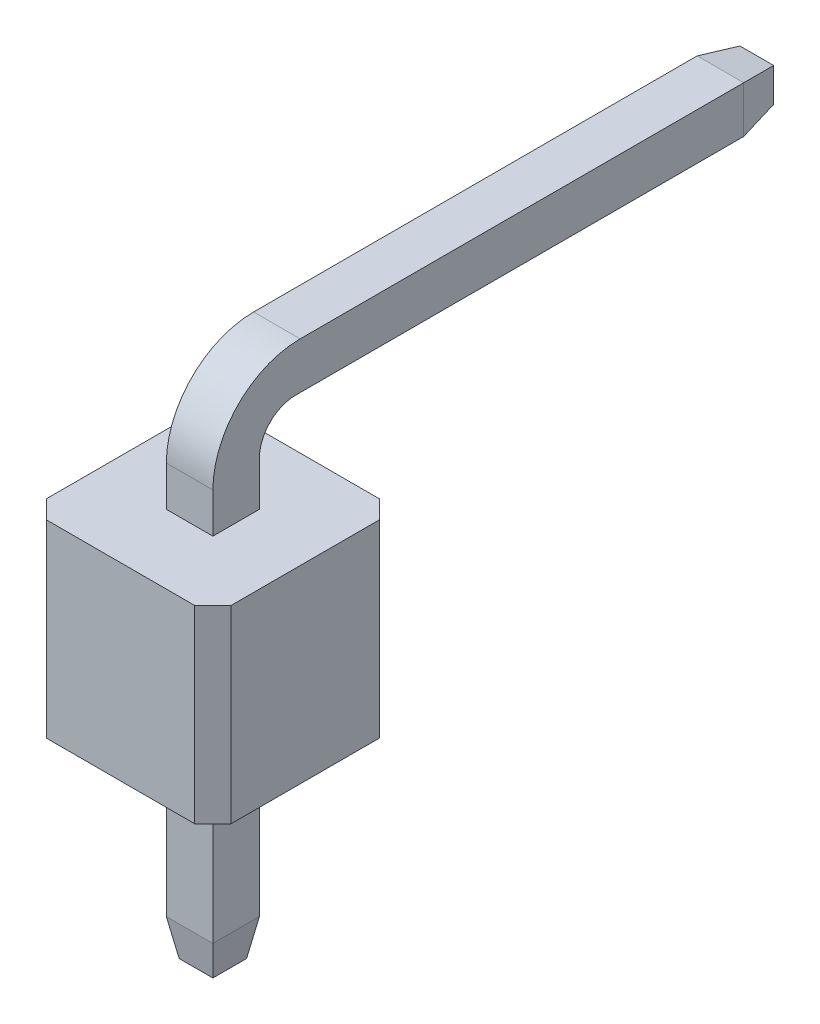
ISO-10303-21;
HEADER;
FILE_DESCRIPTION(('STEP AP214'),'2;1');
FILE_NAME('part.step','',(''),(''),'','','');
FILE_SCHEMA(('AUTOMOTIVE_DESIGN { 1 0 10303 214 1 1 1 1 }'));
ENDSEC;
DATA;
#1=APPLICATION_CONTEXT('core data for automotive mechanical design processes');
#2=APPLICATION_PROTOCOL_DEFINITION('international standard','automotive_design',2000,#1);
#3=PRODUCT_CONTEXT('',#1,'mechanical');
#4=PRODUCT('Part','Part','',(#3));
#5=PRODUCT_RELATED_PRODUCT_CATEGORY('part','',(#4));
#6=PRODUCT_DEFINITION_FORMATION('','',#4);
#7=PRODUCT_DEFINITION_CONTEXT('part definition',#1,'design');
#8=PRODUCT_DEFINITION('design','',#6,#7);
#9=PRODUCT_DEFINITION_SHAPE('','',#8);
#10=(LENGTH_UNIT() NAMED_UNIT(*) SI_UNIT(.MILLI.,.METRE.));
#11=(NAMED_UNIT(*) PLANE_ANGLE_UNIT() SI_UNIT($,.RADIAN.));
#12=(NAMED_UNIT(*) SI_UNIT($,.STERADIAN.) SOLID_ANGLE_UNIT());
#13=UNCERTAINTY_MEASURE_WITH_UNIT(LENGTH_MEASURE(1.E-05),#10,'distance_accuracy_value','');
#14=(GEOMETRIC_REPRESENTATION_CONTEXT(3) GLOBAL_UNCERTAINTY_ASSIGNED_CONTEXT((#13)) GLOBAL_UNIT_ASSIGNED_CONTEXT((#10,
#11,#12)) REPRESENTATION_CONTEXT('',''));
#15=CARTESIAN_POINT('',(0.,0.,0.));
#16=DIRECTION('',(0.,0.,1.));
#17=DIRECTION('',(1.,0.,0.));
#18=AXIS2_PLACEMENT_3D('',#15,#16,#17);
#19=CARTESIAN_POINT('',(0.,2.6,1.27));
#20=DIRECTION('',(0.,0.,-1.));
#21=DIRECTION('',(-1.,0.,0.));
#22=AXIS2_PLACEMENT_3D('',#19,#20,#21);
#23=PLANE('',#22);
#24=DIRECTION('',(1.,0.,0.));
#25=VECTOR('',#24,1.);
#26=CARTESIAN_POINT('',(0.,2.6,1.27));
#27=LINE('',#26,#25);
#28=CARTESIAN_POINT('',(-1.02,2.6,1.27));
#29=VERTEX_POINT('',#28);
#30=CARTESIAN_POINT('',(1.02,2.6,1.27));
#31=VERTEX_POINT('',#30);
#32=EDGE_CURVE('P0_E153',#29,#31,#27,.T.);
#33=ORIENTED_EDGE('',*,*,#32,.F.);
#34=DIRECTION('',(0.,-1.,0.));
#35=VECTOR('',#34,1.);
#36=CARTESIAN_POINT('',(-1.02,0.,1.27));
#37=LINE('',#36,#35);
#38=CARTESIAN_POINT('',(-1.02,0.,1.27));
#39=VERTEX_POINT('',#38);
#40=EDGE_CURVE('P0_E209',#29,#39,#37,.T.);
#41=ORIENTED_EDGE('',*,*,#40,.T.);
#42=DIRECTION('',(1.,0.,0.));
#43=VECTOR('',#42,1.);
#44=CARTESIAN_POINT('',(0.,0.,1.27));
#45=LINE('',#44,#43);
#46=CARTESIAN_POINT('',(1.02,0.,1.27));
#47=VERTEX_POINT('',#46);
#48=EDGE_CURVE('P0_E166',#39,#47,#45,.T.);
#49=ORIENTED_EDGE('',*,*,#48,.T.);
#50=DIRECTION('',(0.,1.,0.));
#51=VECTOR('',#50,1.);
#52=CARTESIAN_POINT('',(1.02,2.6,1.27));
#53=LINE('',#52,#51);
#54=EDGE_CURVE('P0_E207',#47,#31,#53,.T.);
#55=ORIENTED_EDGE('',*,*,#54,.T.);
#56=EDGE_LOOP('',(#33,#41,#49,#55));
#57=FACE_BOUND('',#56,.T.);
#58=ADVANCED_FACE('P0_F17',(#57),#23,.F.);
#59=CARTESIAN_POINT('',(1.27,2.6,0.));
#60=DIRECTION('',(-1.,0.,0.));
#61=DIRECTION('',(0.,0.,1.));
#62=AXIS2_PLACEMENT_3D('',#59,#60,#61);
#63=PLANE('',#62);
#64=DIRECTION('',(0.,0.,-1.));
#65=VECTOR('',#64,1.);
#66=CARTESIAN_POINT('',(1.27,0.,0.));
#67=LINE('',#66,#65);
#68=CARTESIAN_POINT('',(1.27,0.,1.02));
#69=VERTEX_POINT('',#68);
#70=CARTESIAN_POINT('',(1.27,0.,-1.02));
#71=VERTEX_POINT('',#70);
#72=EDGE_CURVE('P0_E169',#69,#71,#67,.T.);
#73=ORIENTED_EDGE('',*,*,#72,.T.);
#74=DIRECTION('',(0.,1.,0.));
#75=VECTOR('',#74,1.);
#76=CARTESIAN_POINT('',(1.27,2.6,-1.02));
#77=LINE('',#76,#75);
#78=CARTESIAN_POINT('',(1.27,2.6,-1.02));
#79=VERTEX_POINT('',#78);
#80=EDGE_CURVE('P0_E193',#71,#79,#77,.T.);
#81=ORIENTED_EDGE('',*,*,#80,.T.);
#82=DIRECTION('',(0.,0.,-1.));
#83=VECTOR('',#82,1.);
#84=CARTESIAN_POINT('',(1.27,2.6,0.));
#85=LINE('',#84,#83);
#86=CARTESIAN_POINT('',(1.27,2.6,1.02));
#87=VERTEX_POINT('',#86);
#88=EDGE_CURVE('P0_E156',#87,#79,#85,.T.);
#89=ORIENTED_EDGE('',*,*,#88,.F.);
#90=DIRECTION('',(0.,-1.,0.));
#91=VECTOR('',#90,1.);
#92=CARTESIAN_POINT('',(1.27,2.6,1.02));
#93=LINE('',#92,#91);
#94=EDGE_CURVE('P0_E190',#87,#69,#93,.T.);
#95=ORIENTED_EDGE('',*,*,#94,.T.);
#96=EDGE_LOOP('',(#73,#81,#89,#95));
#97=FACE_BOUND('',#96,.T.);
#98=ADVANCED_FACE('P0_F266',(#97),#63,.F.);
#99=CARTESIAN_POINT('',(0.,2.6,-1.27));
#100=DIRECTION('',(0.,0.,-1.));
#101=DIRECTION('',(-1.,0.,0.));
#102=AXIS2_PLACEMENT_3D('',#99,#100,#101);
#103=PLANE('',#102);
#104=DIRECTION('',(1.,0.,0.));
#105=VECTOR('',#104,1.);
#106=CARTESIAN_POINT('',(0.,2.6,-1.27));
#107=LINE('',#106,#105);
#108=CARTESIAN_POINT('',(-1.02,2.6,-1.27));
#109=VERTEX_POINT('',#108);
#110=CARTESIAN_POINT('',(1.02,2.6,-1.27));
#111=VERTEX_POINT('',#110);
#112=EDGE_CURVE('P0_E160',#109,#111,#107,.T.);
#113=ORIENTED_EDGE('',*,*,#112,.T.);
#114=DIRECTION('',(0.,-1.,0.));
#115=VECTOR('',#114,1.);
#116=CARTESIAN_POINT('',(1.02,0.,-1.27));
#117=LINE('',#116,#115);
#118=CARTESIAN_POINT('',(1.02,0.,-1.27));
#119=VERTEX_POINT('',#118);
#120=EDGE_CURVE('P0_E179',#111,#119,#117,.T.);
#121=ORIENTED_EDGE('',*,*,#120,.T.);
#122=DIRECTION('',(1.,0.,0.));
#123=VECTOR('',#122,1.);
#124=CARTESIAN_POINT('',(0.,0.,-1.27));
#125=LINE('',#124,#123);
#126=CARTESIAN_POINT('',(-1.02,0.,-1.27));
#127=VERTEX_POINT('',#126);
#128=EDGE_CURVE('P0_E173',#127,#119,#125,.T.);
#129=ORIENTED_EDGE('',*,*,#128,.F.);
#130=DIRECTION('',(0.,1.,0.));
#131=VECTOR('',#130,1.);
#132=CARTESIAN_POINT('',(-1.02,2.6,-1.27));
#133=LINE('',#132,#131);
#134=EDGE_CURVE('P0_E165',#127,#109,#133,.T.);
#135=ORIENTED_EDGE('',*,*,#134,.T.);
#136=EDGE_LOOP('',(#113,#121,#129,#135));
#137=FACE_BOUND('',#136,.T.);
#138=ADVANCED_FACE('P0_F274',(#137),#103,.T.);
#139=CARTESIAN_POINT('',(-1.27,2.6,0.));
#140=DIRECTION('',(-1.,0.,0.));
#141=DIRECTION('',(0.,0.,1.));
#142=AXIS2_PLACEMENT_3D('',#139,#140,#141);
#143=PLANE('',#142);
#144=DIRECTION('',(0.,0.,-1.));
#145=VECTOR('',#144,1.);
#146=CARTESIAN_POINT('',(-1.27,2.6,0.));
#147=LINE('',#146,#145);
#148=CARTESIAN_POINT('',(-1.27,2.6,1.02));
#149=VERTEX_POINT('',#148);
#150=CARTESIAN_POINT('',(-1.27,2.6,-1.02));
#151=VERTEX_POINT('',#150);
#152=EDGE_CURVE('P0_E163',#149,#151,#147,.T.);
#153=ORIENTED_EDGE('',*,*,#152,.T.);
#154=DIRECTION('',(0.,-1.,0.));
#155=VECTOR('',#154,1.);
#156=CARTESIAN_POINT('',(-1.27,2.6,-1.02));
#157=LINE('',#156,#155);
#158=CARTESIAN_POINT('',(-1.27,0.,-1.02));
#159=VERTEX_POINT('',#158);
#160=EDGE_CURVE('P0_E204',#151,#159,#157,.T.);
#161=ORIENTED_EDGE('',*,*,#160,.T.);
#162=DIRECTION('',(0.,0.,-1.));
#163=VECTOR('',#162,1.);
#164=CARTESIAN_POINT('',(-1.27,0.,0.));
#165=LINE('',#164,#163);
#166=CARTESIAN_POINT('',(-1.27,0.,1.02));
#167=VERTEX_POINT('',#166);
#168=EDGE_CURVE('P0_E157',#167,#159,#165,.T.);
#169=ORIENTED_EDGE('',*,*,#168,.F.);
#170=DIRECTION('',(0.,1.,0.));
#171=VECTOR('',#170,1.);
#172=CARTESIAN_POINT('',(-1.27,2.6,1.02));
#173=LINE('',#172,#171);
#174=EDGE_CURVE('P0_E202',#167,#149,#173,.T.);
#175=ORIENTED_EDGE('',*,*,#174,.T.);
#176=EDGE_LOOP('',(#153,#161,#169,#175));
#177=FACE_BOUND('',#176,.T.);
#178=ADVANCED_FACE('P0_F314',(#177),#143,.T.);
#179=CARTESIAN_POINT('',(0.,2.6,0.));
#180=DIRECTION('',(0.,1.,0.));
#181=DIRECTION('',(0.,0.,1.));
#182=AXIS2_PLACEMENT_3D('',#179,#180,#181);
#183=PLANE('',#182);
#184=ORIENTED_EDGE('',*,*,#88,.T.);
#185=DIRECTION('',(-0.707106781186546,0.,-0.707106781186549));
#186=VECTOR('',#185,1.);
#187=CARTESIAN_POINT('',(1.145,2.6,-1.145));
#188=LINE('',#187,#186);
#189=EDGE_CURVE('P0_E200',#79,#111,#188,.T.);
#190=ORIENTED_EDGE('',*,*,#189,.T.);
#191=ORIENTED_EDGE('',*,*,#112,.F.);
#192=DIRECTION('',(0.707106781186549,0.,-0.707106781186546));
#193=VECTOR('',#192,1.);
#194=CARTESIAN_POINT('',(-1.145,2.6,-1.145));
#195=LINE('',#194,#193);
#196=EDGE_CURVE('P0_E40',#109,#151,#195,.F.);
#197=ORIENTED_EDGE('',*,*,#196,.T.);
#198=ORIENTED_EDGE('',*,*,#152,.F.);
#199=DIRECTION('',(0.707106781186546,0.,0.707106781186549));
#200=VECTOR('',#199,1.);
#201=CARTESIAN_POINT('',(-1.145,2.6,1.145));
#202=LINE('',#201,#200);
#203=EDGE_CURVE('P0_E197',#149,#29,#202,.T.);
#204=ORIENTED_EDGE('',*,*,#203,.T.);
#205=ORIENTED_EDGE('',*,*,#32,.T.);
#206=DIRECTION('',(-0.707106781186549,0.,0.707106781186546));
#207=VECTOR('',#206,1.);
#208=CARTESIAN_POINT('',(1.145,2.6,1.145));
#209=LINE('',#208,#207);
#210=EDGE_CURVE('P0_E195',#31,#87,#209,.F.);
#211=ORIENTED_EDGE('',*,*,#210,.T.);
#212=EDGE_LOOP('',(#184,#190,#191,#197,#198,#204,#205,#211));
#213=FACE_BOUND('',#212,.T.);
#214=ADVANCED_FACE('P0_F298',(#213),#183,.T.);
#215=CARTESIAN_POINT('',(0.,0.,0.));
#216=DIRECTION('',(0.,1.,0.));
#217=DIRECTION('',(0.,0.,1.));
#218=AXIS2_PLACEMENT_3D('',#215,#216,#217);
#219=PLANE('',#218);
#220=DIRECTION('',(0.,0.,-1.));
#221=VECTOR('',#220,1.);
#222=CARTESIAN_POINT('',(-0.32,0.,0.));
#223=LINE('',#222,#221);
#224=CARTESIAN_POINT('',(-0.32,0.,0.32));
#225=VERTEX_POINT('',#224);
#226=CARTESIAN_POINT('',(-0.32,0.,-0.32));
#227=VERTEX_POINT('',#226);
#228=EDGE_CURVE('P0_E25',#225,#227,#223,.T.);
#229=ORIENTED_EDGE('',*,*,#228,.F.);
#230=DIRECTION('',(1.,0.,0.));
#231=VECTOR('',#230,1.);
#232=CARTESIAN_POINT('',(0.,0.,0.32));
#233=LINE('',#232,#231);
#234=CARTESIAN_POINT('',(0.32,0.,0.32));
#235=VERTEX_POINT('',#234);
#236=EDGE_CURVE('P0_E11',#225,#235,#233,.T.);
#237=ORIENTED_EDGE('',*,*,#236,.T.);
#238=DIRECTION('',(0.,0.,-1.));
#239=VECTOR('',#238,1.);
#240=CARTESIAN_POINT('',(0.32,0.,0.));
#241=LINE('',#240,#239);
#242=CARTESIAN_POINT('',(0.32,0.,-0.32));
#243=VERTEX_POINT('',#242);
#244=EDGE_CURVE('P0_E212',#235,#243,#241,.T.);
#245=ORIENTED_EDGE('',*,*,#244,.T.);
#246=DIRECTION('',(1.,0.,0.));
#247=VECTOR('',#246,1.);
#248=CARTESIAN_POINT('',(0.,0.,-0.32));
#249=LINE('',#248,#247);
#250=EDGE_CURVE('P0_E215',#227,#243,#249,.T.);
#251=ORIENTED_EDGE('',*,*,#250,.F.);
#252=EDGE_LOOP('',(#229,#237,#245,#251));
#253=FACE_BOUND('',#252,.T.);
#254=ORIENTED_EDGE('',*,*,#128,.T.);
#255=DIRECTION('',(0.707106781186546,0.,0.707106781186549));
#256=VECTOR('',#255,1.);
#257=CARTESIAN_POINT('',(1.02,0.,-1.27));
#258=LINE('',#257,#256);
#259=EDGE_CURVE('P0_E188',#119,#71,#258,.T.);
#260=ORIENTED_EDGE('',*,*,#259,.T.);
#261=ORIENTED_EDGE('',*,*,#72,.F.);
#262=DIRECTION('',(0.707106781186549,0.,-0.707106781186546));
#263=VECTOR('',#262,1.);
#264=CARTESIAN_POINT('',(1.27,0.,1.02));
#265=LINE('',#264,#263);
#266=EDGE_CURVE('P0_E182',#69,#47,#265,.F.);
#267=ORIENTED_EDGE('',*,*,#266,.T.);
#268=ORIENTED_EDGE('',*,*,#48,.F.);
#269=DIRECTION('',(-0.707106781186546,0.,-0.707106781186549));
#270=VECTOR('',#269,1.);
#271=CARTESIAN_POINT('',(-1.02,0.,1.27));
#272=LINE('',#271,#270);
#273=EDGE_CURVE('P0_E184',#39,#167,#272,.T.);
#274=ORIENTED_EDGE('',*,*,#273,.T.);
#275=ORIENTED_EDGE('',*,*,#168,.T.);
#276=DIRECTION('',(-0.707106781186549,0.,0.707106781186546));
#277=VECTOR('',#276,1.);
#278=CARTESIAN_POINT('',(-1.27,0.,-1.02));
#279=LINE('',#278,#277);
#280=EDGE_CURVE('P0_E186',#159,#127,#279,.F.);
#281=ORIENTED_EDGE('',*,*,#280,.T.);
#282=EDGE_LOOP('',(#254,#260,#261,#267,#268,#274,#275,#281));
#283=FACE_BOUND('',#282,.T.);
#284=ADVANCED_FACE('P0_F232',(#253,#283),#219,.F.);
#285=CARTESIAN_POINT('',(1.02,2.6,-1.27));
#286=DIRECTION('',(0.707106781186549,0.,-0.707106781186546));
#287=DIRECTION('',(0.,1.,0.));
#288=AXIS2_PLACEMENT_3D('',#285,#286,#287);
#289=PLANE('',#288);
#290=ORIENTED_EDGE('',*,*,#189,.F.);
#291=ORIENTED_EDGE('',*,*,#80,.F.);
#292=ORIENTED_EDGE('',*,*,#259,.F.);
#293=ORIENTED_EDGE('',*,*,#120,.F.);
#294=EDGE_LOOP('',(#290,#291,#292,#293));
#295=FACE_BOUND('',#294,.T.);
#296=ADVANCED_FACE('P0_F280',(#295),#289,.T.);
#297=CARTESIAN_POINT('',(-1.27,2.6,-1.02));
#298=DIRECTION('',(0.707106781186546,0.,0.707106781186549));
#299=DIRECTION('',(0.,-1.,0.));
#300=AXIS2_PLACEMENT_3D('',#297,#298,#299);
#301=PLANE('',#300);
#302=ORIENTED_EDGE('',*,*,#196,.F.);
#303=ORIENTED_EDGE('',*,*,#134,.F.);
#304=ORIENTED_EDGE('',*,*,#280,.F.);
#305=ORIENTED_EDGE('',*,*,#160,.F.);
#306=EDGE_LOOP('',(#302,#303,#304,#305));
#307=FACE_BOUND('',#306,.T.);
#308=ADVANCED_FACE('P0_F283',(#307),#301,.F.);
#309=CARTESIAN_POINT('',(-1.02,2.6,1.27));
#310=DIRECTION('',(-0.707106781186549,0.,0.707106781186546));
#311=DIRECTION('',(0.,1.,0.));
#312=AXIS2_PLACEMENT_3D('',#309,#310,#311);
#313=PLANE('',#312);
#314=ORIENTED_EDGE('',*,*,#203,.F.);
#315=ORIENTED_EDGE('',*,*,#174,.F.);
#316=ORIENTED_EDGE('',*,*,#273,.F.);
#317=ORIENTED_EDGE('',*,*,#40,.F.);
#318=EDGE_LOOP('',(#314,#315,#316,#317));
#319=FACE_BOUND('',#318,.T.);
#320=ADVANCED_FACE('P0_F286',(#319),#313,.T.);
#321=CARTESIAN_POINT('',(1.27,2.6,1.02));
#322=DIRECTION('',(-0.707106781186546,0.,-0.707106781186549));
#323=DIRECTION('',(0.,-1.,0.));
#324=AXIS2_PLACEMENT_3D('',#321,#322,#323);
#325=PLANE('',#324);
#326=ORIENTED_EDGE('',*,*,#210,.F.);
#327=ORIENTED_EDGE('',*,*,#54,.F.);
#328=ORIENTED_EDGE('',*,*,#266,.F.);
#329=ORIENTED_EDGE('',*,*,#94,.F.);
#330=EDGE_LOOP('',(#326,#327,#328,#329));
#331=FACE_BOUND('',#330,.T.);
#332=ADVANCED_FACE('P0_F19',(#331),#325,.F.);
#333=CARTESIAN_POINT('',(0.,-2.75,0.));
#334=DIRECTION('',(0.,1.,0.));
#335=DIRECTION('',(0.,0.,1.));
#336=AXIS2_PLACEMENT_3D('',#333,#334,#335);
#337=PLANE('',#336);
#338=DIRECTION('',(0.,0.,-1.));
#339=VECTOR('',#338,1.);
#340=CARTESIAN_POINT('',(-0.231836509645768,-2.75,0.));
#341=LINE('',#340,#339);
#342=CARTESIAN_POINT('',(-0.231836509645768,-2.75,0.231836509645769));
#343=VERTEX_POINT('',#342);
#344=CARTESIAN_POINT('',(-0.231836509645768,-2.75,-0.231836509645766));
#345=VERTEX_POINT('',#344);
#346=EDGE_CURVE('P0_E130',#343,#345,#341,.T.);
#347=ORIENTED_EDGE('',*,*,#346,.T.);
#348=DIRECTION('',(1.,0.,0.));
#349=VECTOR('',#348,1.);
#350=CARTESIAN_POINT('',(0.,-2.75,-0.231836509645766));
#351=LINE('',#350,#349);
#352=CARTESIAN_POINT('',(0.231836509645768,-2.75,-0.231836509645766));
#353=VERTEX_POINT('',#352);
#354=EDGE_CURVE('P0_E126',#345,#353,#351,.T.);
#355=ORIENTED_EDGE('',*,*,#354,.T.);
#356=DIRECTION('',(0.,0.,1.));
#357=VECTOR('',#356,1.);
#358=CARTESIAN_POINT('',(0.231836509645768,-2.75,0.32));
#359=LINE('',#358,#357);
#360=CARTESIAN_POINT('',(0.231836509645768,-2.75,0.231836509645769));
#361=VERTEX_POINT('',#360);
#362=EDGE_CURVE('P0_E120',#353,#361,#359,.T.);
#363=ORIENTED_EDGE('',*,*,#362,.T.);
#364=DIRECTION('',(-1.,0.,0.));
#365=VECTOR('',#364,1.);
#366=CARTESIAN_POINT('',(-0.32,-2.75,0.231836509645769));
#367=LINE('',#366,#365);
#368=EDGE_CURVE('P0_E123',#361,#343,#367,.T.);
#369=ORIENTED_EDGE('',*,*,#368,.T.);
#370=EDGE_LOOP('',(#347,#355,#363,#369));
#371=FACE_BOUND('',#370,.T.);
#372=ADVANCED_FACE('P0_F122',(#371),#337,.F.);
#373=CARTESIAN_POINT('',(-0.32,-2.25,0.32));
#374=DIRECTION('',(0.,-0.173648177666927,0.984807753012209));
#375=DIRECTION('',(-1.,0.,0.));
#376=AXIS2_PLACEMENT_3D('',#373,#374,#375);
#377=PLANE('',#376);
#378=DIRECTION('',(0.171087869746033,0.970287525247815,0.171087869746033));
#379=VECTOR('',#378,1.);
#380=CARTESIAN_POINT('',(0.301266522128489,-2.35624283247091,0.30126652212849));
#381=LINE('',#380,#379);
#382=CARTESIAN_POINT('',(0.32,-2.25,0.32));
#383=VERTEX_POINT('',#382);
#384=EDGE_CURVE('P0_E136',#383,#361,#381,.F.);
#385=ORIENTED_EDGE('',*,*,#384,.F.);
#386=DIRECTION('',(1.,0.,0.));
#387=VECTOR('',#386,1.);
#388=CARTESIAN_POINT('',(0.32,-2.25,0.32));
#389=LINE('',#388,#387);
#390=CARTESIAN_POINT('',(-0.32,-2.25,0.32));
#391=VERTEX_POINT('',#390);
#392=EDGE_CURVE('P0_E170',#391,#383,#389,.T.);
#393=ORIENTED_EDGE('',*,*,#392,.F.);
#394=DIRECTION('',(-0.171087869746033,0.970287525247815,0.171087869746033));
#395=VECTOR('',#394,1.);
#396=CARTESIAN_POINT('',(-0.32,-2.25,0.32));
#397=LINE('',#396,#395);
#398=EDGE_CURVE('P0_E139',#343,#391,#397,.T.);
#399=ORIENTED_EDGE('',*,*,#398,.F.);
#400=ORIENTED_EDGE('',*,*,#368,.F.);
#401=EDGE_LOOP('',(#385,#393,#399,#400));
#402=FACE_BOUND('',#401,.T.);
#403=ADVANCED_FACE('P0_F134',(#402),#377,.T.);
#404=CARTESIAN_POINT('',(-0.231836509645768,-2.75,0.));
#405=DIRECTION('',(0.984807753012209,0.173648177666927,0.));
#406=DIRECTION('',(0.,0.,-1.));
#407=AXIS2_PLACEMENT_3D('',#404,#405,#406);
#408=PLANE('',#407);
#409=ORIENTED_EDGE('',*,*,#398,.T.);
#410=DIRECTION('',(0.,0.,1.));
#411=VECTOR('',#410,1.);
#412=CARTESIAN_POINT('',(-0.32,-2.25,0.32));
#413=LINE('',#412,#411);
#414=CARTESIAN_POINT('',(-0.32,-2.25,-0.32));
#415=VERTEX_POINT('',#414);
#416=EDGE_CURVE('P0_E246',#415,#391,#413,.T.);
#417=ORIENTED_EDGE('',*,*,#416,.F.);
#418=DIRECTION('',(0.171087869746033,-0.970287525247815,0.171087869746033));
#419=VECTOR('',#418,1.);
#420=CARTESIAN_POINT('',(-0.225050409453179,-2.78848588664833,-0.225050409453178));
#421=LINE('',#420,#419);
#422=EDGE_CURVE('P0_E145',#345,#415,#421,.F.);
#423=ORIENTED_EDGE('',*,*,#422,.F.);
#424=ORIENTED_EDGE('',*,*,#346,.F.);
#425=EDGE_LOOP('',(#409,#417,#423,#424));
#426=FACE_BOUND('',#425,.T.);
#427=ADVANCED_FACE('P0_F253',(#426),#408,.F.);
#428=CARTESIAN_POINT('',(0.,-2.75,-0.231836509645766));
#429=DIRECTION('',(0.,0.173648177666927,0.984807753012209));
#430=DIRECTION('',(1.,0.,0.));
#431=AXIS2_PLACEMENT_3D('',#428,#429,#430);
#432=PLANE('',#431);
#433=ORIENTED_EDGE('',*,*,#422,.T.);
#434=DIRECTION('',(-1.,0.,0.));
#435=VECTOR('',#434,1.);
#436=CARTESIAN_POINT('',(-0.32,-2.25,-0.32));
#437=LINE('',#436,#435);
#438=CARTESIAN_POINT('',(0.32,-2.25,-0.32));
#439=VERTEX_POINT('',#438);
#440=EDGE_CURVE('P0_E230',#439,#415,#437,.T.);
#441=ORIENTED_EDGE('',*,*,#440,.F.);
#442=DIRECTION('',(-0.171087869746033,-0.970287525247815,0.171087869746033));
#443=VECTOR('',#442,1.);
#444=CARTESIAN_POINT('',(0.301266522128489,-2.35624283247091,-0.301266522128488));
#445=LINE('',#444,#443);
#446=EDGE_CURVE('P0_E149',#439,#353,#445,.T.);
#447=ORIENTED_EDGE('',*,*,#446,.T.);
#448=ORIENTED_EDGE('',*,*,#354,.F.);
#449=EDGE_LOOP('',(#433,#441,#447,#448));
#450=FACE_BOUND('',#449,.T.);
#451=ADVANCED_FACE('P0_F249',(#450),#432,.F.);
#452=CARTESIAN_POINT('',(0.32,-2.25,0.32));
#453=DIRECTION('',(0.984807753012209,-0.173648177666927,0.));
#454=DIRECTION('',(0.,0.,1.));
#455=AXIS2_PLACEMENT_3D('',#452,#453,#454);
#456=PLANE('',#455);
#457=ORIENTED_EDGE('',*,*,#384,.T.);
#458=ORIENTED_EDGE('',*,*,#362,.F.);
#459=ORIENTED_EDGE('',*,*,#446,.F.);
#460=DIRECTION('',(0.,0.,-1.));
#461=VECTOR('',#460,1.);
#462=CARTESIAN_POINT('',(0.32,-2.25,-0.32));
#463=LINE('',#462,#461);
#464=EDGE_CURVE('P0_E144',#383,#439,#463,.T.);
#465=ORIENTED_EDGE('',*,*,#464,.F.);
#466=EDGE_LOOP('',(#457,#458,#459,#465));
#467=FACE_BOUND('',#466,.T.);
#468=ADVANCED_FACE('P0_F143',(#467),#456,.T.);
#469=CARTESIAN_POINT('',(0.32,-2.75,0.32));
#470=DIRECTION('',(1.,0.,0.));
#471=DIRECTION('',(0.,0.,-1.));
#472=AXIS2_PLACEMENT_3D('',#469,#470,#471);
#473=PLANE('',#472);
#474=ORIENTED_EDGE('',*,*,#244,.F.);
#475=DIRECTION('',(0.,1.,0.));
#476=VECTOR('',#475,1.);
#477=CARTESIAN_POINT('',(0.32,-2.75,0.32));
#478=LINE('',#477,#476);
#479=EDGE_CURVE('P0_E147',#383,#235,#478,.T.);
#480=ORIENTED_EDGE('',*,*,#479,.F.);
#481=ORIENTED_EDGE('',*,*,#464,.T.);
#482=DIRECTION('',(0.,1.,0.));
#483=VECTOR('',#482,1.);
#484=CARTESIAN_POINT('',(0.32,-2.75,-0.32));
#485=LINE('',#484,#483);
#486=EDGE_CURVE('P0_E32',#439,#243,#485,.T.);
#487=ORIENTED_EDGE('',*,*,#486,.T.);
#488=EDGE_LOOP('',(#474,#480,#481,#487));
#489=FACE_BOUND('',#488,.T.);
#490=ADVANCED_FACE('P0_F236',(#489),#473,.T.);
#491=CARTESIAN_POINT('',(-0.32,-2.75,-0.32));
#492=DIRECTION('',(0.,0.,1.));
#493=DIRECTION('',(1.,0.,0.));
#494=AXIS2_PLACEMENT_3D('',#491,#492,#493);
#495=PLANE('',#494);
#496=DIRECTION('',(0.,1.,0.));
#497=VECTOR('',#496,1.);
#498=CARTESIAN_POINT('',(-0.32,-2.75,-0.32));
#499=LINE('',#498,#497);
#500=EDGE_CURVE('P0_E222',#415,#227,#499,.T.);
#501=ORIENTED_EDGE('',*,*,#500,.T.);
#502=ORIENTED_EDGE('',*,*,#250,.T.);
#503=ORIENTED_EDGE('',*,*,#486,.F.);
#504=ORIENTED_EDGE('',*,*,#440,.T.);
#505=EDGE_LOOP('',(#501,#502,#503,#504));
#506=FACE_BOUND('',#505,.T.);
#507=ADVANCED_FACE('P0_F228',(#506),#495,.F.);
#508=CARTESIAN_POINT('',(-0.32,-2.75,0.32));
#509=DIRECTION('',(1.,0.,0.));
#510=DIRECTION('',(0.,0.,-1.));
#511=AXIS2_PLACEMENT_3D('',#508,#509,#510);
#512=PLANE('',#511);
#513=DIRECTION('',(0.,1.,0.));
#514=VECTOR('',#513,1.);
#515=CARTESIAN_POINT('',(-0.32,-2.75,0.32));
#516=LINE('',#515,#514);
#517=EDGE_CURVE('P0_E141',#391,#225,#516,.T.);
#518=ORIENTED_EDGE('',*,*,#517,.T.);
#519=ORIENTED_EDGE('',*,*,#228,.T.);
#520=ORIENTED_EDGE('',*,*,#500,.F.);
#521=ORIENTED_EDGE('',*,*,#416,.T.);
#522=EDGE_LOOP('',(#518,#519,#520,#521));
#523=FACE_BOUND('',#522,.T.);
#524=ADVANCED_FACE('P0_F221',(#523),#512,.F.);
#525=CARTESIAN_POINT('',(-0.32,-2.75,0.32));
#526=DIRECTION('',(0.,0.,1.));
#527=DIRECTION('',(1.,0.,0.));
#528=AXIS2_PLACEMENT_3D('',#525,#526,#527);
#529=PLANE('',#528);
#530=ORIENTED_EDGE('',*,*,#236,.F.);
#531=ORIENTED_EDGE('',*,*,#517,.F.);
#532=ORIENTED_EDGE('',*,*,#392,.T.);
#533=ORIENTED_EDGE('',*,*,#479,.T.);
#534=EDGE_LOOP('',(#530,#531,#532,#533));
#535=FACE_BOUND('',#534,.T.);
#536=ADVANCED_FACE('P0_F238',(#535),#529,.T.);
#537=CLOSED_SHELL('',(#58,#98,#138,#178,#214,#284,#296,#308,#320,#332,#372,#403,#427,#451,#468,
#490,#507,#524,#536));
#538=MANIFOLD_SOLID_BREP('P0_B1',#537);
#539=CARTESIAN_POINT('',(0.32,4.35,-7.48));
#540=DIRECTION('',(0.,0.,1.));
#541=DIRECTION('',(1.,0.,0.));
#542=AXIS2_PLACEMENT_3D('',#539,#540,#541);
#543=PLANE('',#542);
#544=DIRECTION('',(0.,-1.,0.));
#545=VECTOR('',#544,1.);
#546=CARTESIAN_POINT('',(0.231836509645767,4.35,-7.48));
#547=LINE('',#546,#545);
#548=CARTESIAN_POINT('',(0.231836509645767,4.26183650964577,-7.48));
#549=VERTEX_POINT('',#548);
#550=CARTESIAN_POINT('',(0.231836509645767,3.79816349035423,-7.48));
#551=VERTEX_POINT('',#550);
#552=EDGE_CURVE('P1_E153',#549,#551,#547,.T.);
#553=ORIENTED_EDGE('',*,*,#552,.T.);
#554=DIRECTION('',(-1.,0.,0.));
#555=VECTOR('',#554,1.);
#556=CARTESIAN_POINT('',(0.32,3.79816349035423,-7.48));
#557=LINE('',#556,#555);
#558=CARTESIAN_POINT('',(-0.231836509645767,3.79816349035423,-7.48));
#559=VERTEX_POINT('',#558);
#560=EDGE_CURVE('P1_E155',#551,#559,#557,.T.);
#561=ORIENTED_EDGE('',*,*,#560,.T.);
#562=DIRECTION('',(0.,1.,0.));
#563=VECTOR('',#562,1.);
#564=CARTESIAN_POINT('',(-0.231836509645767,4.35,-7.48));
#565=LINE('',#564,#563);
#566=CARTESIAN_POINT('',(-0.231836509645767,4.26183650964577,-7.48));
#567=VERTEX_POINT('',#566);
#568=EDGE_CURVE('P1_E106',#559,#567,#565,.T.);
#569=ORIENTED_EDGE('',*,*,#568,.T.);
#570=DIRECTION('',(1.,0.,0.));
#571=VECTOR('',#570,1.);
#572=CARTESIAN_POINT('',(0.32,4.26183650964577,-7.48));
#573=LINE('',#572,#571);
#574=EDGE_CURVE('P1_E151',#567,#549,#573,.T.);
#575=ORIENTED_EDGE('',*,*,#574,.T.);
#576=EDGE_LOOP('',(#553,#561,#569,#575));
#577=FACE_BOUND('',#576,.T.);
#578=ADVANCED_FACE('P1_F17',(#577),#543,.F.);
#579=CARTESIAN_POINT('',(0.32,4.35,-0.88));
#580=DIRECTION('',(0.,-1.,0.));
#581=DIRECTION('',(0.,0.,-1.));
#582=AXIS2_PLACEMENT_3D('',#579,#580,#581);
#583=PLANE('',#582);
#584=DIRECTION('',(0.,0.,1.));
#585=VECTOR('',#584,1.);
#586=CARTESIAN_POINT('',(0.32,4.35,-0.88));
#587=LINE('',#586,#585);
#588=CARTESIAN_POINT('',(0.32,4.35,-6.98));
#589=VERTEX_POINT('',#588);
#590=CARTESIAN_POINT('',(0.32,4.35,-0.88));
#591=VERTEX_POINT('',#590);
#592=EDGE_CURVE('P1_E92',#589,#591,#587,.T.);
#593=ORIENTED_EDGE('',*,*,#592,.F.);
#594=DIRECTION('',(-1.,0.,0.));
#595=VECTOR('',#594,1.);
#596=CARTESIAN_POINT('',(0.32,4.35,-6.98));
#597=LINE('',#596,#595);
#598=CARTESIAN_POINT('',(-0.32,4.35,-6.98));
#599=VERTEX_POINT('',#598);
#600=EDGE_CURVE('P1_E26',#589,#599,#597,.T.);
#601=ORIENTED_EDGE('',*,*,#600,.T.);
#602=DIRECTION('',(0.,0.,1.));
#603=VECTOR('',#602,1.);
#604=CARTESIAN_POINT('',(-0.32,4.35,-0.88));
#605=LINE('',#604,#603);
#606=CARTESIAN_POINT('',(-0.32,4.35,-0.88));
#607=VERTEX_POINT('',#606);
#608=EDGE_CURVE('P1_E103',#599,#607,#605,.T.);
#609=ORIENTED_EDGE('',*,*,#608,.T.);
#610=DIRECTION('',(-1.,0.,0.));
#611=VECTOR('',#610,1.);
#612=CARTESIAN_POINT('',(0.32,4.35,-0.88));
#613=LINE('',#612,#611);
#614=EDGE_CURVE('P1_E101',#591,#607,#613,.T.);
#615=ORIENTED_EDGE('',*,*,#614,.F.);
#616=EDGE_LOOP('',(#593,#601,#609,#615));
#617=FACE_BOUND('',#616,.T.);
#618=ADVANCED_FACE('P1_F102',(#617),#583,.F.);
#619=CARTESIAN_POINT('',(0.32,3.15,-0.88));
#620=DIRECTION('',(-1.,0.,0.));
#621=DIRECTION('',(0.,0.,1.));
#622=AXIS2_PLACEMENT_3D('',#619,#620,#621);
#623=CYLINDRICAL_SURFACE('',#622,1.2);
#624=CARTESIAN_POINT('',(-0.32,3.15,-0.88));
#625=DIRECTION('',(1.,0.,0.));
#626=DIRECTION('',(0.,0.,1.));
#627=AXIS2_PLACEMENT_3D('',#624,#625,#626);
#628=CIRCLE('',#627,1.2);
#629=CARTESIAN_POINT('',(-0.32,3.15,0.32));
#630=VERTEX_POINT('',#629);
#631=EDGE_CURVE('P1_E126',#607,#630,#628,.T.);
#632=ORIENTED_EDGE('',*,*,#631,.T.);
#633=DIRECTION('',(-1.,0.,0.));
#634=VECTOR('',#633,1.);
#635=CARTESIAN_POINT('',(0.32,3.15,0.32));
#636=LINE('',#635,#634);
#637=CARTESIAN_POINT('',(0.32,3.15,0.32));
#638=VERTEX_POINT('',#637);
#639=EDGE_CURVE('P1_E107',#638,#630,#636,.T.);
#640=ORIENTED_EDGE('',*,*,#639,.F.);
#641=CARTESIAN_POINT('',(0.32,3.15,-0.88));
#642=DIRECTION('',(1.,0.,0.));
#643=DIRECTION('',(0.,0.,1.));
#644=AXIS2_PLACEMENT_3D('',#641,#642,#643);
#645=CIRCLE('',#644,1.2);
#646=EDGE_CURVE('P1_E96',#591,#638,#645,.T.);
#647=ORIENTED_EDGE('',*,*,#646,.F.);
#648=ORIENTED_EDGE('',*,*,#614,.T.);
#649=EDGE_LOOP('',(#632,#640,#647,#648));
#650=FACE_BOUND('',#649,.T.);
#651=ADVANCED_FACE('P1_F109',(#650),#623,.T.);
#652=CARTESIAN_POINT('',(0.32,2.6,0.32));
#653=DIRECTION('',(0.,0.,-1.));
#654=DIRECTION('',(-1.,0.,0.));
#655=AXIS2_PLACEMENT_3D('',#652,#653,#654);
#656=PLANE('',#655);
#657=DIRECTION('',(0.,-1.,0.));
#658=VECTOR('',#657,1.);
#659=CARTESIAN_POINT('',(-0.32,2.6,0.32));
#660=LINE('',#659,#658);
#661=CARTESIAN_POINT('',(-0.32,2.6,0.32));
#662=VERTEX_POINT('',#661);
#663=EDGE_CURVE('P1_E128',#630,#662,#660,.T.);
#664=ORIENTED_EDGE('',*,*,#663,.T.);
#665=DIRECTION('',(-1.,0.,0.));
#666=VECTOR('',#665,1.);
#667=CARTESIAN_POINT('',(0.32,2.6,0.32));
#668=LINE('',#667,#666);
#669=CARTESIAN_POINT('',(0.32,2.6,0.32));
#670=VERTEX_POINT('',#669);
#671=EDGE_CURVE('P1_E146',#670,#662,#668,.T.);
#672=ORIENTED_EDGE('',*,*,#671,.F.);
#673=DIRECTION('',(0.,-1.,0.));
#674=VECTOR('',#673,1.);
#675=CARTESIAN_POINT('',(0.32,2.6,0.32));
#676=LINE('',#675,#674);
#677=EDGE_CURVE('P1_E112',#638,#670,#676,.T.);
#678=ORIENTED_EDGE('',*,*,#677,.F.);
#679=ORIENTED_EDGE('',*,*,#639,.T.);
#680=EDGE_LOOP('',(#664,#672,#678,#679));
#681=FACE_BOUND('',#680,.T.);
#682=ADVANCED_FACE('P1_F237',(#681),#656,.F.);
#683=CARTESIAN_POINT('',(0.32,2.6,0.32));
#684=DIRECTION('',(0.,1.,0.));
#685=DIRECTION('',(0.,0.,1.));
#686=AXIS2_PLACEMENT_3D('',#683,#684,#685);
#687=PLANE('',#686);
#688=DIRECTION('',(0.,0.,-1.));
#689=VECTOR('',#688,1.);
#690=CARTESIAN_POINT('',(-0.32,2.6,0.32));
#691=LINE('',#690,#689);
#692=CARTESIAN_POINT('',(-0.32,2.6,-0.32));
#693=VERTEX_POINT('',#692);
#694=EDGE_CURVE('P1_E130',#662,#693,#691,.T.);
#695=ORIENTED_EDGE('',*,*,#694,.T.);
#696=DIRECTION('',(-1.,0.,0.));
#697=VECTOR('',#696,1.);
#698=CARTESIAN_POINT('',(0.32,2.6,-0.32));
#699=LINE('',#698,#697);
#700=CARTESIAN_POINT('',(0.32,2.6,-0.32));
#701=VERTEX_POINT('',#700);
#702=EDGE_CURVE('P1_E143',#701,#693,#699,.T.);
#703=ORIENTED_EDGE('',*,*,#702,.F.);
#704=DIRECTION('',(0.,0.,-1.));
#705=VECTOR('',#704,1.);
#706=CARTESIAN_POINT('',(0.32,2.6,0.32));
#707=LINE('',#706,#705);
#708=EDGE_CURVE('P1_E114',#670,#701,#707,.T.);
#709=ORIENTED_EDGE('',*,*,#708,.F.);
#710=ORIENTED_EDGE('',*,*,#671,.T.);
#711=EDGE_LOOP('',(#695,#703,#709,#710));
#712=FACE_BOUND('',#711,.T.);
#713=ADVANCED_FACE('P1_F233',(#712),#687,.F.);
#714=CARTESIAN_POINT('',(0.32,3.21,-0.32));
#715=DIRECTION('',(0.,0.,1.));
#716=DIRECTION('',(0.,-1.,0.));
#717=AXIS2_PLACEMENT_3D('',#714,#715,#716);
#718=PLANE('',#717);
#719=DIRECTION('',(0.,1.,0.));
#720=VECTOR('',#719,1.);
#721=CARTESIAN_POINT('',(-0.32,3.21,-0.32));
#722=LINE('',#721,#720);
#723=CARTESIAN_POINT('',(-0.32,3.21,-0.32));
#724=VERTEX_POINT('',#723);
#725=EDGE_CURVE('P1_E132',#693,#724,#722,.T.);
#726=ORIENTED_EDGE('',*,*,#725,.T.);
#727=DIRECTION('',(-1.,0.,0.));
#728=VECTOR('',#727,1.);
#729=CARTESIAN_POINT('',(0.32,3.21,-0.32));
#730=LINE('',#729,#728);
#731=CARTESIAN_POINT('',(0.32,3.21,-0.32));
#732=VERTEX_POINT('',#731);
#733=EDGE_CURVE('P1_E140',#732,#724,#730,.T.);
#734=ORIENTED_EDGE('',*,*,#733,.F.);
#735=DIRECTION('',(0.,1.,0.));
#736=VECTOR('',#735,1.);
#737=CARTESIAN_POINT('',(0.32,3.21,-0.32));
#738=LINE('',#737,#736);
#739=EDGE_CURVE('P1_E118',#701,#732,#738,.T.);
#740=ORIENTED_EDGE('',*,*,#739,.F.);
#741=ORIENTED_EDGE('',*,*,#702,.T.);
#742=EDGE_LOOP('',(#726,#734,#740,#741));
#743=FACE_BOUND('',#742,.T.);
#744=ADVANCED_FACE('P1_F229',(#743),#718,.F.);
#745=CARTESIAN_POINT('',(0.32,3.21,-0.82));
#746=DIRECTION('',(-1.,0.,0.));
#747=DIRECTION('',(0.,0.,1.));
#748=AXIS2_PLACEMENT_3D('',#745,#746,#747);
#749=CYLINDRICAL_SURFACE('',#748,0.5);
#750=CARTESIAN_POINT('',(-0.32,3.21,-0.82));
#751=DIRECTION('',(-1.,0.,0.));
#752=DIRECTION('',(0.,0.,1.));
#753=AXIS2_PLACEMENT_3D('',#750,#751,#752);
#754=CIRCLE('',#753,0.5);
#755=CARTESIAN_POINT('',(-0.32,3.71,-0.82));
#756=VERTEX_POINT('',#755);
#757=EDGE_CURVE('P1_E134',#724,#756,#754,.T.);
#758=ORIENTED_EDGE('',*,*,#757,.T.);
#759=DIRECTION('',(-1.,0.,0.));
#760=VECTOR('',#759,1.);
#761=CARTESIAN_POINT('',(0.32,3.71,-0.82));
#762=LINE('',#761,#760);
#763=CARTESIAN_POINT('',(0.32,3.71,-0.82));
#764=VERTEX_POINT('',#763);
#765=EDGE_CURVE('P1_E124',#764,#756,#762,.T.);
#766=ORIENTED_EDGE('',*,*,#765,.F.);
#767=CARTESIAN_POINT('',(0.32,3.21,-0.82));
#768=DIRECTION('',(-1.,0.,0.));
#769=DIRECTION('',(0.,0.,1.));
#770=AXIS2_PLACEMENT_3D('',#767,#768,#769);
#771=CIRCLE('',#770,0.5);
#772=EDGE_CURVE('P1_E120',#732,#764,#771,.T.);
#773=ORIENTED_EDGE('',*,*,#772,.F.);
#774=ORIENTED_EDGE('',*,*,#733,.T.);
#775=EDGE_LOOP('',(#758,#766,#773,#774));
#776=FACE_BOUND('',#775,.T.);
#777=ADVANCED_FACE('P1_F226',(#776),#749,.F.);
#778=CARTESIAN_POINT('',(0.32,3.71,-7.48));
#779=DIRECTION('',(0.,1.,0.));
#780=DIRECTION('',(0.,0.,1.));
#781=AXIS2_PLACEMENT_3D('',#778,#779,#780);
#782=PLANE('',#781);
#783=DIRECTION('',(0.,0.,-1.));
#784=VECTOR('',#783,1.);
#785=CARTESIAN_POINT('',(-0.32,3.71,-7.48));
#786=LINE('',#785,#784);
#787=CARTESIAN_POINT('',(-0.32,3.71,-6.98));
#788=VERTEX_POINT('',#787);
#789=EDGE_CURVE('P1_E98',#756,#788,#786,.T.);
#790=ORIENTED_EDGE('',*,*,#789,.T.);
#791=DIRECTION('',(1.,0.,0.));
#792=VECTOR('',#791,1.);
#793=CARTESIAN_POINT('',(0.32,3.71,-6.98));
#794=LINE('',#793,#792);
#795=CARTESIAN_POINT('',(0.32,3.71,-6.98));
#796=VERTEX_POINT('',#795);
#797=EDGE_CURVE('P1_E158',#788,#796,#794,.T.);
#798=ORIENTED_EDGE('',*,*,#797,.T.);
#799=DIRECTION('',(0.,0.,-1.));
#800=VECTOR('',#799,1.);
#801=CARTESIAN_POINT('',(0.32,3.71,-7.48));
#802=LINE('',#801,#800);
#803=EDGE_CURVE('P1_E122',#764,#796,#802,.T.);
#804=ORIENTED_EDGE('',*,*,#803,.F.);
#805=ORIENTED_EDGE('',*,*,#765,.T.);
#806=EDGE_LOOP('',(#790,#798,#804,#805));
#807=FACE_BOUND('',#806,.T.);
#808=ADVANCED_FACE('P1_F188',(#807),#782,.F.);
#809=CARTESIAN_POINT('',(0.32,3.21,-0.82));
#810=DIRECTION('',(-1.,0.,0.));
#811=DIRECTION('',(0.,0.,1.));
#812=AXIS2_PLACEMENT_3D('',#809,#810,#811);
#813=PLANE('',#812);
#814=ORIENTED_EDGE('',*,*,#803,.T.);
#815=DIRECTION('',(0.,1.,0.));
#816=VECTOR('',#815,1.);
#817=CARTESIAN_POINT('',(0.32,3.21,-6.98));
#818=LINE('',#817,#816);
#819=EDGE_CURVE('P1_E41',#796,#589,#818,.T.);
#820=ORIENTED_EDGE('',*,*,#819,.T.);
#821=ORIENTED_EDGE('',*,*,#592,.T.);
#822=ORIENTED_EDGE('',*,*,#646,.T.);
#823=ORIENTED_EDGE('',*,*,#677,.T.);
#824=ORIENTED_EDGE('',*,*,#708,.T.);
#825=ORIENTED_EDGE('',*,*,#739,.T.);
#826=ORIENTED_EDGE('',*,*,#772,.T.);
#827=EDGE_LOOP('',(#814,#820,#821,#822,#823,#824,#825,#826));
#828=FACE_BOUND('',#827,.T.);
#829=ADVANCED_FACE('P1_F94',(#828),#813,.F.);
#830=CARTESIAN_POINT('',(-0.32,3.21,-0.82));
#831=DIRECTION('',(-1.,0.,0.));
#832=DIRECTION('',(0.,0.,1.));
#833=AXIS2_PLACEMENT_3D('',#830,#831,#832);
#834=PLANE('',#833);
#835=ORIENTED_EDGE('',*,*,#608,.F.);
#836=DIRECTION('',(0.,-1.,0.));
#837=VECTOR('',#836,1.);
#838=CARTESIAN_POINT('',(-0.32,3.71,-6.98));
#839=LINE('',#838,#837);
#840=EDGE_CURVE('P1_E11',#599,#788,#839,.T.);
#841=ORIENTED_EDGE('',*,*,#840,.T.);
#842=ORIENTED_EDGE('',*,*,#789,.F.);
#843=ORIENTED_EDGE('',*,*,#757,.F.);
#844=ORIENTED_EDGE('',*,*,#725,.F.);
#845=ORIENTED_EDGE('',*,*,#694,.F.);
#846=ORIENTED_EDGE('',*,*,#663,.F.);
#847=ORIENTED_EDGE('',*,*,#631,.F.);
#848=EDGE_LOOP('',(#835,#841,#842,#843,#844,#845,#846,#847));
#849=FACE_BOUND('',#848,.T.);
#850=ADVANCED_FACE('P1_F184',(#849),#834,.T.);
#851=CARTESIAN_POINT('',(0.32,4.35,-6.98));
#852=DIRECTION('',(0.,-0.984807753012209,0.173648177666928));
#853=DIRECTION('',(-1.,0.,0.));
#854=AXIS2_PLACEMENT_3D('',#851,#852,#853);
#855=PLANE('',#854);
#856=DIRECTION('',(-0.171087869746033,0.171087869746033,0.970287525247815));
#857=VECTOR('',#856,1.);
#858=CARTESIAN_POINT('',(-0.234417148388933,4.26441714838893,-7.46536447041288));
#859=LINE('',#858,#857);
#860=EDGE_CURVE('P1_E166',#599,#567,#859,.F.);
#861=ORIENTED_EDGE('',*,*,#860,.F.);
#862=ORIENTED_EDGE('',*,*,#600,.F.);
#863=DIRECTION('',(-0.171087869746033,-0.171087869746033,-0.970287525247815));
#864=VECTOR('',#863,1.);
#865=CARTESIAN_POINT('',(0.32,4.35,-6.98));
#866=LINE('',#865,#864);
#867=EDGE_CURVE('P1_E21',#549,#589,#866,.F.);
#868=ORIENTED_EDGE('',*,*,#867,.F.);
#869=ORIENTED_EDGE('',*,*,#574,.F.);
#870=EDGE_LOOP('',(#861,#862,#868,#869));
#871=FACE_BOUND('',#870,.T.);
#872=ADVANCED_FACE('P1_F19',(#871),#855,.F.);
#873=CARTESIAN_POINT('',(0.32,3.21,-6.98));
#874=DIRECTION('',(-0.984807753012209,0.,0.173648177666928));
#875=DIRECTION('',(0.,1.,0.));
#876=AXIS2_PLACEMENT_3D('',#873,#874,#875);
#877=PLANE('',#876);
#878=ORIENTED_EDGE('',*,*,#867,.T.);
#879=ORIENTED_EDGE('',*,*,#819,.F.);
#880=DIRECTION('',(-0.171087869746033,0.171087869746033,-0.970287525247815));
#881=VECTOR('',#880,1.);
#882=CARTESIAN_POINT('',(0.334635529587118,3.69536447041288,-6.89699778713209));
#883=LINE('',#882,#881);
#884=EDGE_CURVE('P1_E165',#551,#796,#883,.F.);
#885=ORIENTED_EDGE('',*,*,#884,.F.);
#886=ORIENTED_EDGE('',*,*,#552,.F.);
#887=EDGE_LOOP('',(#878,#879,#885,#886));
#888=FACE_BOUND('',#887,.T.);
#889=ADVANCED_FACE('P1_F176',(#888),#877,.F.);
#890=CARTESIAN_POINT('',(-0.231836509645767,4.35,-7.48));
#891=DIRECTION('',(-0.984807753012209,0.,-0.173648177666928));
#892=DIRECTION('',(0.,-1.,0.));
#893=AXIS2_PLACEMENT_3D('',#890,#891,#892);
#894=PLANE('',#893);
#895=ORIENTED_EDGE('',*,*,#860,.T.);
#896=ORIENTED_EDGE('',*,*,#568,.F.);
#897=DIRECTION('',(0.171087869746033,0.171087869746033,-0.970287525247815));
#898=VECTOR('',#897,1.);
#899=CARTESIAN_POINT('',(-0.215683670517422,3.81431632948258,-7.57160730288379));
#900=LINE('',#899,#898);
#901=EDGE_CURVE('P1_E163',#788,#559,#900,.T.);
#902=ORIENTED_EDGE('',*,*,#901,.F.);
#903=ORIENTED_EDGE('',*,*,#840,.F.);
#904=EDGE_LOOP('',(#895,#896,#902,#903));
#905=FACE_BOUND('',#904,.T.);
#906=ADVANCED_FACE('P1_F181',(#905),#894,.T.);
#907=CARTESIAN_POINT('',(0.32,3.79816349035423,-7.48));
#908=DIRECTION('',(0.,0.984807753012209,0.173648177666928));
#909=DIRECTION('',(-1.,0.,0.));
#910=AXIS2_PLACEMENT_3D('',#907,#908,#909);
#911=PLANE('',#910);
#912=ORIENTED_EDGE('',*,*,#884,.T.);
#913=ORIENTED_EDGE('',*,*,#797,.F.);
#914=ORIENTED_EDGE('',*,*,#901,.T.);
#915=ORIENTED_EDGE('',*,*,#560,.F.);
#916=EDGE_LOOP('',(#912,#913,#914,#915));
#917=FACE_BOUND('',#916,.T.);
#918=ADVANCED_FACE('P1_F192',(#917),#911,.F.);
#919=CLOSED_SHELL('',(#578,#618,#651,#682,#713,#744,#777,#808,#829,#850,#872,#889,#906,#918));
#920=MANIFOLD_SOLID_BREP('P1_B1',#919);
#921=ADVANCED_BREP_SHAPE_REPRESENTATION('',(#18,#538,#920),#14);
#922=SHAPE_DEFINITION_REPRESENTATION(#9,#921);
ENDSEC;
END-ISO-10303-21;
